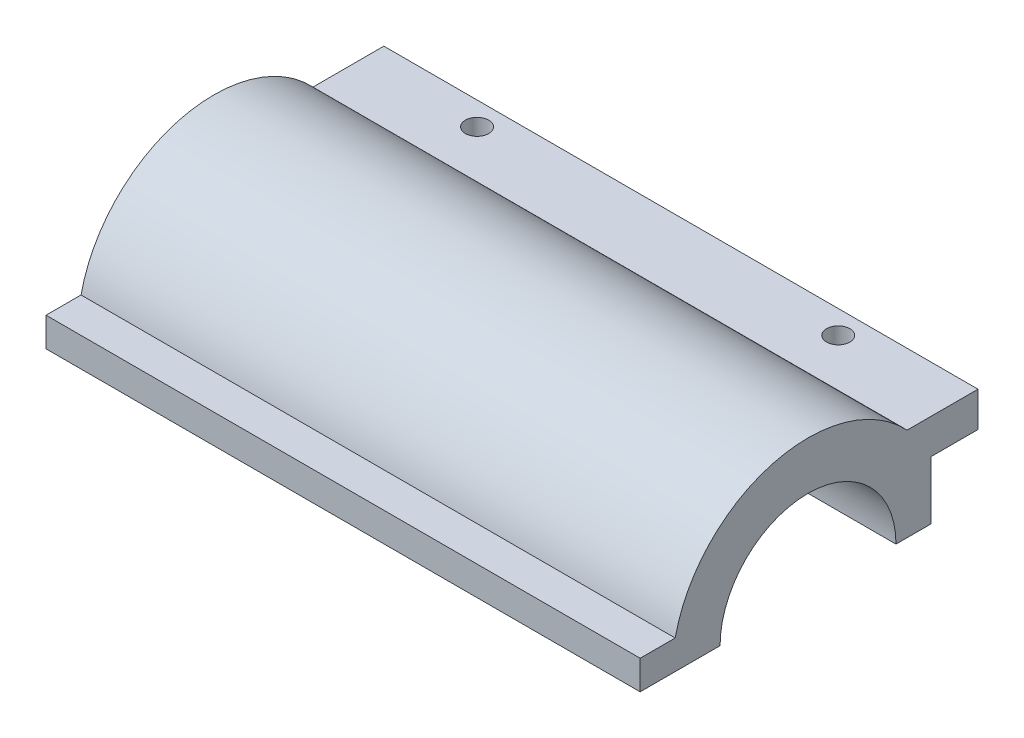
ISO-10303-21;
HEADER;
FILE_DESCRIPTION(('STEP AP214'),'2;1');
FILE_NAME('part.step','',(''),(''),'','','');
FILE_SCHEMA(('AUTOMOTIVE_DESIGN { 1 0 10303 214 1 1 1 1 }'));
ENDSEC;
DATA;
#1=APPLICATION_CONTEXT('core data for automotive mechanical design processes');
#2=APPLICATION_PROTOCOL_DEFINITION('international standard','automotive_design',2000,#1);
#3=PRODUCT_CONTEXT('',#1,'mechanical');
#4=PRODUCT('Part','Part','',(#3));
#5=PRODUCT_RELATED_PRODUCT_CATEGORY('part','',(#4));
#6=PRODUCT_DEFINITION_FORMATION('','',#4);
#7=PRODUCT_DEFINITION_CONTEXT('part definition',#1,'design');
#8=PRODUCT_DEFINITION('design','',#6,#7);
#9=PRODUCT_DEFINITION_SHAPE('','',#8);
#10=(LENGTH_UNIT() NAMED_UNIT(*) SI_UNIT(.MILLI.,.METRE.));
#11=(NAMED_UNIT(*) PLANE_ANGLE_UNIT() SI_UNIT($,.RADIAN.));
#12=(NAMED_UNIT(*) SI_UNIT($,.STERADIAN.) SOLID_ANGLE_UNIT());
#13=UNCERTAINTY_MEASURE_WITH_UNIT(LENGTH_MEASURE(1.E-05),#10,'distance_accuracy_value','');
#14=(GEOMETRIC_REPRESENTATION_CONTEXT(3) GLOBAL_UNCERTAINTY_ASSIGNED_CONTEXT((#13)) GLOBAL_UNIT_ASSIGNED_CONTEXT((#10,
#11,#12)) REPRESENTATION_CONTEXT('',''));
#15=CARTESIAN_POINT('',(0.,0.,0.));
#16=DIRECTION('',(0.,0.,1.));
#17=DIRECTION('',(1.,0.,0.));
#18=AXIS2_PLACEMENT_3D('',#15,#16,#17);
#19=CARTESIAN_POINT('',(51.,-9.85068941930374,9.80213445976491));
#20=DIRECTION('',(0.,-1.,0.));
#21=DIRECTION('',(0.,0.,-1.));
#22=AXIS2_PLACEMENT_3D('',#19,#20,#21);
#23=PLANE('',#22);
#24=DIRECTION('',(0.,0.,1.));
#25=VECTOR('',#24,1.);
#26=CARTESIAN_POINT('',(0.,-9.85068941930374,9.80213445976491));
#27=LINE('',#26,#25);
#28=CARTESIAN_POINT('',(0.,-9.85068941930374,6.79619075566244));
#29=VERTEX_POINT('',#28);
#30=CARTESIAN_POINT('',(0.,-9.85068941930374,9.80213445976491));
#31=VERTEX_POINT('',#30);
#32=EDGE_CURVE('E141',#29,#31,#27,.T.);
#33=ORIENTED_EDGE('',*,*,#32,.T.);
#34=DIRECTION('',(-1.,0.,0.));
#35=VECTOR('',#34,1.);
#36=CARTESIAN_POINT('',(51.,-9.85068941930374,9.80213445976491));
#37=LINE('',#36,#35);
#38=CARTESIAN_POINT('',(51.,-9.85068941930374,9.80213445976491));
#39=VERTEX_POINT('',#38);
#40=EDGE_CURVE('E11',#39,#31,#37,.T.);
#41=ORIENTED_EDGE('',*,*,#40,.F.);
#42=DIRECTION('',(0.,0.,1.));
#43=VECTOR('',#42,1.);
#44=CARTESIAN_POINT('',(51.,-9.85068941930374,9.80213445976491));
#45=LINE('',#44,#43);
#46=CARTESIAN_POINT('',(51.,-9.85068941930374,6.79619075566244));
#47=VERTEX_POINT('',#46);
#48=EDGE_CURVE('E160',#47,#39,#45,.T.);
#49=ORIENTED_EDGE('',*,*,#48,.F.);
#50=DIRECTION('',(-1.,0.,0.));
#51=VECTOR('',#50,1.);
#52=CARTESIAN_POINT('',(51.,-9.85068941930374,6.79619075566244));
#53=LINE('',#52,#51);
#54=EDGE_CURVE('E137',#47,#29,#53,.T.);
#55=ORIENTED_EDGE('',*,*,#54,.T.);
#56=EDGE_LOOP('',(#33,#41,#49,#55));
#57=FACE_BOUND('',#56,.T.);
#58=ADVANCED_FACE('F33',(#57),#23,.F.);
#59=CARTESIAN_POINT('',(51.,-9.85068941930374,9.80213445976491));
#60=DIRECTION('',(0.,0.,-1.));
#61=DIRECTION('',(-1.,0.,0.));
#62=AXIS2_PLACEMENT_3D('',#59,#60,#61);
#63=PLANE('',#62);
#64=DIRECTION('',(0.,-1.,0.));
#65=VECTOR('',#64,1.);
#66=CARTESIAN_POINT('',(0.,-9.85068941930374,9.80213445976491));
#67=LINE('',#66,#65);
#68=CARTESIAN_POINT('',(0.,-12.3506894193037,9.80213445976491));
#69=VERTEX_POINT('',#68);
#70=EDGE_CURVE('E144',#31,#69,#67,.T.);
#71=ORIENTED_EDGE('',*,*,#70,.T.);
#72=DIRECTION('',(-1.,0.,0.));
#73=VECTOR('',#72,1.);
#74=CARTESIAN_POINT('',(51.,-12.3506894193037,9.80213445976491));
#75=LINE('',#74,#73);
#76=CARTESIAN_POINT('',(51.,-12.3506894193037,9.80213445976491));
#77=VERTEX_POINT('',#76);
#78=EDGE_CURVE('E41',#77,#69,#75,.T.);
#79=ORIENTED_EDGE('',*,*,#78,.F.);
#80=DIRECTION('',(0.,-1.,0.));
#81=VECTOR('',#80,1.);
#82=CARTESIAN_POINT('',(51.,-9.85068941930374,9.80213445976491));
#83=LINE('',#82,#81);
#84=EDGE_CURVE('E98',#39,#77,#83,.T.);
#85=ORIENTED_EDGE('',*,*,#84,.F.);
#86=ORIENTED_EDGE('',*,*,#40,.T.);
#87=EDGE_LOOP('',(#71,#79,#85,#86));
#88=FACE_BOUND('',#87,.T.);
#89=ADVANCED_FACE('F253',(#88),#63,.F.);
#90=CARTESIAN_POINT('',(51.,-12.3506894193037,9.80213445976491));
#91=DIRECTION('',(0.,1.,0.));
#92=DIRECTION('',(0.,0.,1.));
#93=AXIS2_PLACEMENT_3D('',#90,#91,#92);
#94=PLANE('',#93);
#95=DIRECTION('',(0.,0.,-1.));
#96=VECTOR('',#95,1.);
#97=CARTESIAN_POINT('',(0.,-12.3506894193037,9.80213445976491));
#98=LINE('',#97,#96);
#99=CARTESIAN_POINT('',(0.,-12.3506894193037,2.94213445976491));
#100=VERTEX_POINT('',#99);
#101=EDGE_CURVE('E147',#69,#100,#98,.T.);
#102=ORIENTED_EDGE('',*,*,#101,.T.);
#103=DIRECTION('',(-1.,0.,0.));
#104=VECTOR('',#103,1.);
#105=CARTESIAN_POINT('',(51.,-12.3506894193037,2.94213445976491));
#106=LINE('',#105,#104);
#107=CARTESIAN_POINT('',(51.,-12.3506894193037,2.94213445976491));
#108=VERTEX_POINT('',#107);
#109=EDGE_CURVE('E173',#108,#100,#106,.T.);
#110=ORIENTED_EDGE('',*,*,#109,.F.);
#111=DIRECTION('',(0.,0.,-1.));
#112=VECTOR('',#111,1.);
#113=CARTESIAN_POINT('',(51.,-12.3506894193037,9.80213445976491));
#114=LINE('',#113,#112);
#115=EDGE_CURVE('E181',#77,#108,#114,.T.);
#116=ORIENTED_EDGE('',*,*,#115,.F.);
#117=ORIENTED_EDGE('',*,*,#78,.T.);
#118=EDGE_LOOP('',(#102,#110,#116,#117));
#119=FACE_BOUND('',#118,.T.);
#120=ADVANCED_FACE('F179',(#119),#94,.F.);
#121=CARTESIAN_POINT('',(51.,-12.3506894193037,-4.60786554023509));
#122=DIRECTION('',(-1.,0.,0.));
#123=DIRECTION('',(0.,0.,1.));
#124=AXIS2_PLACEMENT_3D('',#121,#122,#123);
#125=CYLINDRICAL_SURFACE('',#124,7.55);
#126=CARTESIAN_POINT('',(0.,-12.3506894193037,-4.60786554023509));
#127=DIRECTION('',(-1.,0.,0.));
#128=DIRECTION('',(0.,0.,-1.));
#129=AXIS2_PLACEMENT_3D('',#126,#127,#128);
#130=CIRCLE('',#129,7.55);
#131=CARTESIAN_POINT('',(0.,-12.3506894193037,-12.1578655402351));
#132=VERTEX_POINT('',#131);
#133=EDGE_CURVE('E149',#100,#132,#130,.T.);
#134=ORIENTED_EDGE('',*,*,#133,.T.);
#135=DIRECTION('',(-1.,0.,0.));
#136=VECTOR('',#135,1.);
#137=CARTESIAN_POINT('',(51.,-12.3506894193037,-12.1578655402351));
#138=LINE('',#137,#136);
#139=CARTESIAN_POINT('',(51.,-12.3506894193037,-12.1578655402351));
#140=VERTEX_POINT('',#139);
#141=EDGE_CURVE('E170',#140,#132,#138,.T.);
#142=ORIENTED_EDGE('',*,*,#141,.F.);
#143=CARTESIAN_POINT('',(51.,-12.3506894193037,-4.60786554023509));
#144=DIRECTION('',(-1.,0.,0.));
#145=DIRECTION('',(0.,0.,-1.));
#146=AXIS2_PLACEMENT_3D('',#143,#144,#145);
#147=CIRCLE('',#146,7.55);
#148=EDGE_CURVE('E199',#108,#140,#147,.T.);
#149=ORIENTED_EDGE('',*,*,#148,.F.);
#150=ORIENTED_EDGE('',*,*,#109,.T.);
#151=EDGE_LOOP('',(#134,#142,#149,#150));
#152=FACE_BOUND('',#151,.T.);
#153=ADVANCED_FACE('F190',(#152),#125,.F.);
#154=CARTESIAN_POINT('',(51.,-12.3506894193037,-12.1578655402351));
#155=DIRECTION('',(0.,1.,0.));
#156=DIRECTION('',(0.,0.,1.));
#157=AXIS2_PLACEMENT_3D('',#154,#155,#156);
#158=PLANE('',#157);
#159=DIRECTION('',(0.,0.,-1.));
#160=VECTOR('',#159,1.);
#161=CARTESIAN_POINT('',(0.,-12.3506894193037,-12.1578655402351));
#162=LINE('',#161,#160);
#163=CARTESIAN_POINT('',(0.,-12.3506894193037,-15.1578655402351));
#164=VERTEX_POINT('',#163);
#165=EDGE_CURVE('E151',#132,#164,#162,.T.);
#166=ORIENTED_EDGE('',*,*,#165,.T.);
#167=DIRECTION('',(-1.,0.,0.));
#168=VECTOR('',#167,1.);
#169=CARTESIAN_POINT('',(51.,-12.3506894193037,-15.1578655402351));
#170=LINE('',#169,#168);
#171=CARTESIAN_POINT('',(51.,-12.3506894193037,-15.1578655402351));
#172=VERTEX_POINT('',#171);
#173=EDGE_CURVE('E167',#172,#164,#170,.T.);
#174=ORIENTED_EDGE('',*,*,#173,.F.);
#175=DIRECTION('',(0.,0.,-1.));
#176=VECTOR('',#175,1.);
#177=CARTESIAN_POINT('',(51.,-12.3506894193037,-12.1578655402351));
#178=LINE('',#177,#176);
#179=EDGE_CURVE('E196',#140,#172,#178,.T.);
#180=ORIENTED_EDGE('',*,*,#179,.F.);
#181=ORIENTED_EDGE('',*,*,#141,.T.);
#182=EDGE_LOOP('',(#166,#174,#180,#181));
#183=FACE_BOUND('',#182,.T.);
#184=ADVANCED_FACE('F194',(#183),#158,.F.);
#185=CARTESIAN_POINT('',(51.,-12.3506894193037,-15.1578655402351));
#186=DIRECTION('',(0.,0.,1.));
#187=DIRECTION('',(1.,0.,0.));
#188=AXIS2_PLACEMENT_3D('',#185,#186,#187);
#189=PLANE('',#188);
#190=DIRECTION('',(0.,1.,0.));
#191=VECTOR('',#190,1.);
#192=CARTESIAN_POINT('',(0.,-12.3506894193037,-15.1578655402351));
#193=LINE('',#192,#191);
#194=CARTESIAN_POINT('',(0.,-7.35068941930374,-15.1578655402351));
#195=VERTEX_POINT('',#194);
#196=EDGE_CURVE('E153',#164,#195,#193,.T.);
#197=ORIENTED_EDGE('',*,*,#196,.T.);
#198=DIRECTION('',(-1.,0.,0.));
#199=VECTOR('',#198,1.);
#200=CARTESIAN_POINT('',(51.,-7.35068941930374,-15.1578655402351));
#201=LINE('',#200,#199);
#202=CARTESIAN_POINT('',(51.,-7.35068941930374,-15.1578655402351));
#203=VERTEX_POINT('',#202);
#204=EDGE_CURVE('E164',#203,#195,#201,.T.);
#205=ORIENTED_EDGE('',*,*,#204,.F.);
#206=DIRECTION('',(0.,1.,0.));
#207=VECTOR('',#206,1.);
#208=CARTESIAN_POINT('',(51.,-12.3506894193037,-15.1578655402351));
#209=LINE('',#208,#207);
#210=EDGE_CURVE('E198',#172,#203,#209,.T.);
#211=ORIENTED_EDGE('',*,*,#210,.F.);
#212=ORIENTED_EDGE('',*,*,#173,.T.);
#213=EDGE_LOOP('',(#197,#205,#211,#212));
#214=FACE_BOUND('',#213,.T.);
#215=ADVANCED_FACE('F237',(#214),#189,.F.);
#216=CARTESIAN_POINT('',(51.,-7.35068941930374,-15.1578655402351));
#217=DIRECTION('',(0.,1.,0.));
#218=DIRECTION('',(0.,0.,1.));
#219=AXIS2_PLACEMENT_3D('',#216,#217,#218);
#220=PLANE('',#219);
#221=CARTESIAN_POINT('',(41.,-7.35068941930372,-17.1978655402351));
#222=DIRECTION('',(0.,1.,0.));
#223=DIRECTION('',(0.,0.,1.));
#224=AXIS2_PLACEMENT_3D('',#221,#222,#223);
#225=CIRCLE('',#224,0.999999999999998);
#226=CARTESIAN_POINT('',(41.,-7.35068941930372,-16.1978655402351));
#227=VERTEX_POINT('',#226);
#228=EDGE_CURVE('E212',#227,#227,#225,.T.);
#229=ORIENTED_EDGE('',*,*,#228,.T.);
#230=EDGE_LOOP('',(#229));
#231=FACE_BOUND('',#230,.T.);
#232=CARTESIAN_POINT('',(10.,-7.35068941930372,-17.1978655402351));
#233=DIRECTION('',(0.,1.,0.));
#234=DIRECTION('',(0.,0.,1.));
#235=AXIS2_PLACEMENT_3D('',#232,#233,#234);
#236=CIRCLE('',#235,1.);
#237=CARTESIAN_POINT('',(10.,-7.35068941930372,-16.1978655402351));
#238=VERTEX_POINT('',#237);
#239=EDGE_CURVE('E145',#238,#238,#236,.T.);
#240=ORIENTED_EDGE('',*,*,#239,.T.);
#241=EDGE_LOOP('',(#240));
#242=FACE_BOUND('',#241,.T.);
#243=DIRECTION('',(0.,0.,-1.));
#244=VECTOR('',#243,1.);
#245=CARTESIAN_POINT('',(0.,-7.35068941930374,-15.1578655402351));
#246=LINE('',#245,#244);
#247=CARTESIAN_POINT('',(0.,-7.35068941930374,-19.1978655402351));
#248=VERTEX_POINT('',#247);
#249=EDGE_CURVE('E155',#195,#248,#246,.T.);
#250=ORIENTED_EDGE('',*,*,#249,.T.);
#251=DIRECTION('',(-1.,0.,0.));
#252=VECTOR('',#251,1.);
#253=CARTESIAN_POINT('',(51.,-7.35068941930374,-19.1978655402351));
#254=LINE('',#253,#252);
#255=CARTESIAN_POINT('',(51.,-7.35068941930374,-19.1978655402351));
#256=VERTEX_POINT('',#255);
#257=EDGE_CURVE('E132',#256,#248,#254,.T.);
#258=ORIENTED_EDGE('',*,*,#257,.F.);
#259=DIRECTION('',(0.,0.,-1.));
#260=VECTOR('',#259,1.);
#261=CARTESIAN_POINT('',(51.,-7.35068941930374,-15.1578655402351));
#262=LINE('',#261,#260);
#263=EDGE_CURVE('E123',#203,#256,#262,.T.);
#264=ORIENTED_EDGE('',*,*,#263,.F.);
#265=ORIENTED_EDGE('',*,*,#204,.T.);
#266=EDGE_LOOP('',(#250,#258,#264,#265));
#267=FACE_BOUND('',#266,.T.);
#268=ADVANCED_FACE('F234',(#231,#242,#267),#220,.F.);
#269=CARTESIAN_POINT('',(51.,-4.35068941930374,-19.1978655402351));
#270=DIRECTION('',(0.,0.,1.));
#271=DIRECTION('',(1.,0.,0.));
#272=AXIS2_PLACEMENT_3D('',#269,#270,#271);
#273=PLANE('',#272);
#274=DIRECTION('',(0.,1.,0.));
#275=VECTOR('',#274,1.);
#276=CARTESIAN_POINT('',(0.,-4.35068941930374,-19.1978655402351));
#277=LINE('',#276,#275);
#278=CARTESIAN_POINT('',(0.,-4.35068941930374,-19.1978655402351));
#279=VERTEX_POINT('',#278);
#280=EDGE_CURVE('E131',#248,#279,#277,.T.);
#281=ORIENTED_EDGE('',*,*,#280,.T.);
#282=DIRECTION('',(-1.,0.,0.));
#283=VECTOR('',#282,1.);
#284=CARTESIAN_POINT('',(51.,-4.35068941930374,-19.1978655402351));
#285=LINE('',#284,#283);
#286=CARTESIAN_POINT('',(51.,-4.35068941930374,-19.1978655402351));
#287=VERTEX_POINT('',#286);
#288=EDGE_CURVE('E128',#287,#279,#285,.T.);
#289=ORIENTED_EDGE('',*,*,#288,.F.);
#290=DIRECTION('',(0.,1.,0.));
#291=VECTOR('',#290,1.);
#292=CARTESIAN_POINT('',(51.,-4.35068941930374,-19.1978655402351));
#293=LINE('',#292,#291);
#294=EDGE_CURVE('E117',#256,#287,#293,.T.);
#295=ORIENTED_EDGE('',*,*,#294,.F.);
#296=ORIENTED_EDGE('',*,*,#257,.T.);
#297=EDGE_LOOP('',(#281,#289,#295,#296));
#298=FACE_BOUND('',#297,.T.);
#299=ADVANCED_FACE('F129',(#298),#273,.F.);
#300=CARTESIAN_POINT('',(51.,-4.35068941930374,-19.1978655402351));
#301=DIRECTION('',(0.,-1.,0.));
#302=DIRECTION('',(0.,0.,-1.));
#303=AXIS2_PLACEMENT_3D('',#300,#301,#302);
#304=PLANE('',#303);
#305=CARTESIAN_POINT('',(41.,-4.35068941930374,-17.1978655402351));
#306=DIRECTION('',(0.,1.,0.));
#307=DIRECTION('',(0.,0.,1.));
#308=AXIS2_PLACEMENT_3D('',#305,#306,#307);
#309=CIRCLE('',#308,0.999999999999998);
#310=CARTESIAN_POINT('',(41.,-4.35068941930374,-16.1978655402351));
#311=VERTEX_POINT('',#310);
#312=EDGE_CURVE('E215',#311,#311,#309,.T.);
#313=ORIENTED_EDGE('',*,*,#312,.F.);
#314=EDGE_LOOP('',(#313));
#315=FACE_BOUND('',#314,.T.);
#316=CARTESIAN_POINT('',(10.,-4.35068941930374,-17.1978655402351));
#317=DIRECTION('',(0.,1.,0.));
#318=DIRECTION('',(0.,0.,1.));
#319=AXIS2_PLACEMENT_3D('',#316,#317,#318);
#320=CIRCLE('',#319,1.);
#321=CARTESIAN_POINT('',(10.,-4.35068941930374,-16.1978655402351));
#322=VERTEX_POINT('',#321);
#323=EDGE_CURVE('E209',#322,#322,#320,.T.);
#324=ORIENTED_EDGE('',*,*,#323,.F.);
#325=EDGE_LOOP('',(#324));
#326=FACE_BOUND('',#325,.T.);
#327=DIRECTION('',(0.,0.,1.));
#328=VECTOR('',#327,1.);
#329=CARTESIAN_POINT('',(0.,-4.35068941930374,-19.1978655402351));
#330=LINE('',#329,#328);
#331=CARTESIAN_POINT('',(0.,-4.35068941930374,-13.1109532147213));
#332=VERTEX_POINT('',#331);
#333=EDGE_CURVE('E84',#279,#332,#330,.T.);
#334=ORIENTED_EDGE('',*,*,#333,.T.);
#335=DIRECTION('',(-1.,0.,0.));
#336=VECTOR('',#335,1.);
#337=CARTESIAN_POINT('',(51.,-4.35068941930374,-13.1109532147213));
#338=LINE('',#337,#336);
#339=CARTESIAN_POINT('',(51.,-4.35068941930374,-13.1109532147213));
#340=VERTEX_POINT('',#339);
#341=EDGE_CURVE('E133',#340,#332,#338,.T.);
#342=ORIENTED_EDGE('',*,*,#341,.F.);
#343=DIRECTION('',(0.,0.,1.));
#344=VECTOR('',#343,1.);
#345=CARTESIAN_POINT('',(51.,-4.35068941930374,-19.1978655402351));
#346=LINE('',#345,#344);
#347=EDGE_CURVE('E121',#287,#340,#346,.T.);
#348=ORIENTED_EDGE('',*,*,#347,.F.);
#349=ORIENTED_EDGE('',*,*,#288,.T.);
#350=EDGE_LOOP('',(#334,#342,#348,#349));
#351=FACE_BOUND('',#350,.T.);
#352=ADVANCED_FACE('F135',(#315,#326,#351),#304,.F.);
#353=CARTESIAN_POINT('',(51.,-12.3506894193037,-4.60786554023509));
#354=DIRECTION('',(-1.,0.,0.));
#355=DIRECTION('',(0.,0.,1.));
#356=AXIS2_PLACEMENT_3D('',#353,#354,#355);
#357=CYLINDRICAL_SURFACE('',#356,11.6748661662565);
#358=CARTESIAN_POINT('',(0.,-12.3506894193037,-4.60786554023509));
#359=DIRECTION('',(1.,0.,0.));
#360=DIRECTION('',(0.,0.,-1.));
#361=AXIS2_PLACEMENT_3D('',#358,#359,#360);
#362=CIRCLE('',#361,11.6748661662565);
#363=EDGE_CURVE('E90',#332,#29,#362,.T.);
#364=ORIENTED_EDGE('',*,*,#363,.T.);
#365=ORIENTED_EDGE('',*,*,#54,.F.);
#366=CARTESIAN_POINT('',(51.,-12.3506894193037,-4.60786554023509));
#367=DIRECTION('',(1.,0.,0.));
#368=DIRECTION('',(0.,0.,-1.));
#369=AXIS2_PLACEMENT_3D('',#366,#367,#368);
#370=CIRCLE('',#369,11.6748661662565);
#371=EDGE_CURVE('E49',#340,#47,#370,.T.);
#372=ORIENTED_EDGE('',*,*,#371,.F.);
#373=ORIENTED_EDGE('',*,*,#341,.T.);
#374=EDGE_LOOP('',(#364,#365,#372,#373));
#375=FACE_BOUND('',#374,.T.);
#376=ADVANCED_FACE('F224',(#375),#357,.T.);
#377=CARTESIAN_POINT('',(51.,-12.3506894193037,-4.60786554023509));
#378=DIRECTION('',(1.,0.,0.));
#379=DIRECTION('',(0.,0.,-1.));
#380=AXIS2_PLACEMENT_3D('',#377,#378,#379);
#381=PLANE('',#380);
#382=ORIENTED_EDGE('',*,*,#48,.T.);
#383=ORIENTED_EDGE('',*,*,#84,.T.);
#384=ORIENTED_EDGE('',*,*,#115,.T.);
#385=ORIENTED_EDGE('',*,*,#148,.T.);
#386=ORIENTED_EDGE('',*,*,#179,.T.);
#387=ORIENTED_EDGE('',*,*,#210,.T.);
#388=ORIENTED_EDGE('',*,*,#263,.T.);
#389=ORIENTED_EDGE('',*,*,#294,.T.);
#390=ORIENTED_EDGE('',*,*,#347,.T.);
#391=ORIENTED_EDGE('',*,*,#371,.T.);
#392=EDGE_LOOP('',(#382,#383,#384,#385,#386,#387,#388,#389,#390,#391));
#393=FACE_BOUND('',#392,.T.);
#394=ADVANCED_FACE('F119',(#393),#381,.T.);
#395=CARTESIAN_POINT('',(0.,-12.3506894193037,-4.60786554023509));
#396=DIRECTION('',(1.,0.,0.));
#397=DIRECTION('',(0.,0.,-1.));
#398=AXIS2_PLACEMENT_3D('',#395,#396,#397);
#399=PLANE('',#398);
#400=ORIENTED_EDGE('',*,*,#32,.F.);
#401=ORIENTED_EDGE('',*,*,#363,.F.);
#402=ORIENTED_EDGE('',*,*,#333,.F.);
#403=ORIENTED_EDGE('',*,*,#280,.F.);
#404=ORIENTED_EDGE('',*,*,#249,.F.);
#405=ORIENTED_EDGE('',*,*,#196,.F.);
#406=ORIENTED_EDGE('',*,*,#165,.F.);
#407=ORIENTED_EDGE('',*,*,#133,.F.);
#408=ORIENTED_EDGE('',*,*,#101,.F.);
#409=ORIENTED_EDGE('',*,*,#70,.F.);
#410=EDGE_LOOP('',(#400,#401,#402,#403,#404,#405,#406,#407,#408,#409));
#411=FACE_BOUND('',#410,.T.);
#412=ADVANCED_FACE('F185',(#411),#399,.F.);
#413=CARTESIAN_POINT('',(10.,-793.350689419304,-17.1978655402351));
#414=DIRECTION('',(0.,1.,0.));
#415=DIRECTION('',(0.,0.,1.));
#416=AXIS2_PLACEMENT_3D('',#413,#414,#415);
#417=CYLINDRICAL_SURFACE('',#416,1.);
#418=ORIENTED_EDGE('',*,*,#323,.T.);
#419=EDGE_LOOP('',(#418));
#420=FACE_BOUND('',#419,.T.);
#421=ORIENTED_EDGE('',*,*,#239,.F.);
#422=EDGE_LOOP('',(#421));
#423=FACE_BOUND('',#422,.T.);
#424=ADVANCED_FACE('F228',(#420,#423),#417,.F.);
#425=CARTESIAN_POINT('',(41.,-793.350689419304,-17.1978655402351));
#426=DIRECTION('',(0.,1.,0.));
#427=DIRECTION('',(0.,0.,1.));
#428=AXIS2_PLACEMENT_3D('',#425,#426,#427);
#429=CYLINDRICAL_SURFACE('',#428,0.999999999999998);
#430=ORIENTED_EDGE('',*,*,#312,.T.);
#431=EDGE_LOOP('',(#430));
#432=FACE_BOUND('',#431,.T.);
#433=ORIENTED_EDGE('',*,*,#228,.F.);
#434=EDGE_LOOP('',(#433));
#435=FACE_BOUND('',#434,.T.);
#436=ADVANCED_FACE('F219',(#432,#435),#429,.F.);
#437=CLOSED_SHELL('',(#58,#89,#120,#153,#184,#215,#268,#299,#352,#376,#394,#412,#424,#436));
#438=MANIFOLD_SOLID_BREP('B2',#437);
#439=ADVANCED_BREP_SHAPE_REPRESENTATION('',(#18,#438),#14);
#440=SHAPE_DEFINITION_REPRESENTATION(#9,#439);
ENDSEC;
END-ISO-10303-21;
